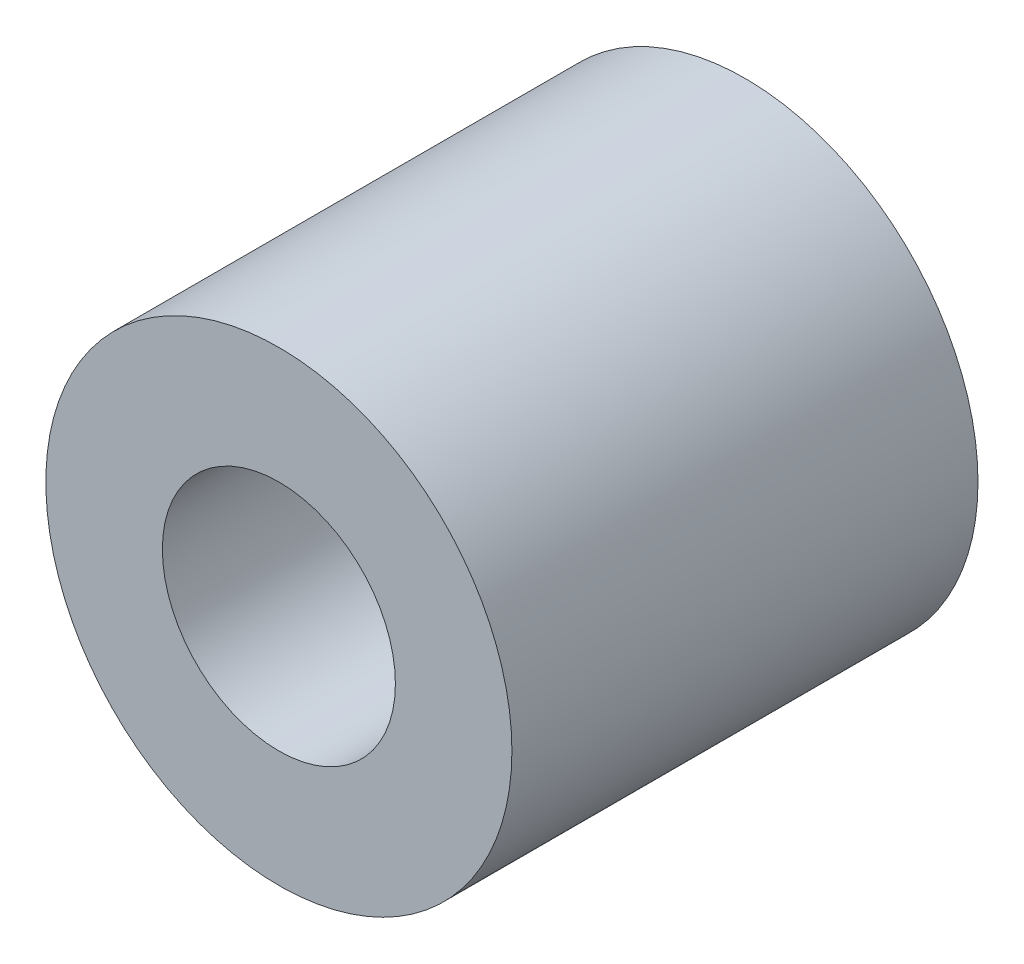
ISO-10303-21;
HEADER;
FILE_DESCRIPTION(('STEP AP214'),'2;1');
FILE_NAME('part.step','',(''),(''),'','','');
FILE_SCHEMA(('AUTOMOTIVE_DESIGN { 1 0 10303 214 1 1 1 1 }'));
ENDSEC;
DATA;
#1=APPLICATION_CONTEXT('core data for automotive mechanical design processes');
#2=APPLICATION_PROTOCOL_DEFINITION('international standard','automotive_design',2000,#1);
#3=PRODUCT_CONTEXT('',#1,'mechanical');
#4=PRODUCT('Part','Part','',(#3));
#5=PRODUCT_RELATED_PRODUCT_CATEGORY('part','',(#4));
#6=PRODUCT_DEFINITION_FORMATION('','',#4);
#7=PRODUCT_DEFINITION_CONTEXT('part definition',#1,'design');
#8=PRODUCT_DEFINITION('design','',#6,#7);
#9=PRODUCT_DEFINITION_SHAPE('','',#8);
#10=(LENGTH_UNIT() NAMED_UNIT(*) SI_UNIT(.MILLI.,.METRE.));
#11=(NAMED_UNIT(*) PLANE_ANGLE_UNIT() SI_UNIT($,.RADIAN.));
#12=(NAMED_UNIT(*) SI_UNIT($,.STERADIAN.) SOLID_ANGLE_UNIT());
#13=UNCERTAINTY_MEASURE_WITH_UNIT(LENGTH_MEASURE(1.E-05),#10,'distance_accuracy_value','');
#14=(GEOMETRIC_REPRESENTATION_CONTEXT(3) GLOBAL_UNCERTAINTY_ASSIGNED_CONTEXT((#13)) GLOBAL_UNIT_ASSIGNED_CONTEXT((#10,
#11,#12)) REPRESENTATION_CONTEXT('',''));
#15=CARTESIAN_POINT('',(0.,0.,0.));
#16=DIRECTION('',(0.,0.,1.));
#17=DIRECTION('',(1.,0.,0.));
#18=AXIS2_PLACEMENT_3D('',#15,#16,#17);
#19=CARTESIAN_POINT('',(0.,0.,10.));
#20=DIRECTION('',(0.,0.,1.));
#21=DIRECTION('',(1.,0.,0.));
#22=AXIS2_PLACEMENT_3D('',#19,#20,#21);
#23=PLANE('',#22);
#24=CARTESIAN_POINT('',(0.,0.,10.));
#25=DIRECTION('',(0.,0.,1.));
#26=DIRECTION('',(1.,0.,0.));
#27=AXIS2_PLACEMENT_3D('',#24,#25,#26);
#28=CIRCLE('',#27,5.);
#29=CARTESIAN_POINT('',(5.,0.,10.));
#30=VERTEX_POINT('',#29);
#31=EDGE_CURVE('E10',#30,#30,#28,.T.);
#32=ORIENTED_EDGE('',*,*,#31,.T.);
#33=EDGE_LOOP('',(#32));
#34=FACE_BOUND('',#33,.T.);
#35=CARTESIAN_POINT('',(0.,0.,10.));
#36=DIRECTION('',(0.,0.,1.));
#37=DIRECTION('',(1.,0.,0.));
#38=AXIS2_PLACEMENT_3D('',#35,#36,#37);
#39=CIRCLE('',#38,2.5);
#40=CARTESIAN_POINT('',(2.5,0.,10.));
#41=VERTEX_POINT('',#40);
#42=EDGE_CURVE('E46',#41,#41,#39,.T.);
#43=ORIENTED_EDGE('',*,*,#42,.F.);
#44=EDGE_LOOP('',(#43));
#45=FACE_BOUND('',#44,.T.);
#46=ADVANCED_FACE('F35',(#34,#45),#23,.T.);
#47=CARTESIAN_POINT('',(0.,0.,0.));
#48=DIRECTION('',(0.,0.,1.));
#49=DIRECTION('',(1.,0.,0.));
#50=AXIS2_PLACEMENT_3D('',#47,#48,#49);
#51=PLANE('',#50);
#52=CARTESIAN_POINT('',(0.,0.,0.));
#53=DIRECTION('',(0.,0.,1.));
#54=DIRECTION('',(1.,0.,0.));
#55=AXIS2_PLACEMENT_3D('',#52,#53,#54);
#56=CIRCLE('',#55,5.);
#57=CARTESIAN_POINT('',(5.,0.,0.));
#58=VERTEX_POINT('',#57);
#59=EDGE_CURVE('E39',#58,#58,#56,.T.);
#60=ORIENTED_EDGE('',*,*,#59,.F.);
#61=EDGE_LOOP('',(#60));
#62=FACE_BOUND('',#61,.T.);
#63=CARTESIAN_POINT('',(0.,0.,0.));
#64=DIRECTION('',(0.,0.,1.));
#65=DIRECTION('',(1.,0.,0.));
#66=AXIS2_PLACEMENT_3D('',#63,#64,#65);
#67=CIRCLE('',#66,2.5);
#68=CARTESIAN_POINT('',(2.5,0.,0.));
#69=VERTEX_POINT('',#68);
#70=EDGE_CURVE('E48',#69,#69,#67,.T.);
#71=ORIENTED_EDGE('',*,*,#70,.T.);
#72=EDGE_LOOP('',(#71));
#73=FACE_BOUND('',#72,.T.);
#74=ADVANCED_FACE('F58',(#62,#73),#51,.F.);
#75=CARTESIAN_POINT('',(0.,0.,10.));
#76=DIRECTION('',(0.,0.,-1.));
#77=DIRECTION('',(-1.,0.,0.));
#78=AXIS2_PLACEMENT_3D('',#75,#76,#77);
#79=CYLINDRICAL_SURFACE('',#78,5.);
#80=ORIENTED_EDGE('',*,*,#31,.F.);
#81=EDGE_LOOP('',(#80));
#82=FACE_BOUND('',#81,.T.);
#83=ORIENTED_EDGE('',*,*,#59,.T.);
#84=EDGE_LOOP('',(#83));
#85=FACE_BOUND('',#84,.T.);
#86=ADVANCED_FACE('F37',(#82,#85),#79,.T.);
#87=CARTESIAN_POINT('',(0.,0.,10.));
#88=DIRECTION('',(0.,0.,-1.));
#89=DIRECTION('',(-1.,0.,0.));
#90=AXIS2_PLACEMENT_3D('',#87,#88,#89);
#91=CYLINDRICAL_SURFACE('',#90,2.5);
#92=ORIENTED_EDGE('',*,*,#42,.T.);
#93=EDGE_LOOP('',(#92));
#94=FACE_BOUND('',#93,.T.);
#95=ORIENTED_EDGE('',*,*,#70,.F.);
#96=EDGE_LOOP('',(#95));
#97=FACE_BOUND('',#96,.T.);
#98=ADVANCED_FACE('F54',(#94,#97),#91,.F.);
#99=CLOSED_SHELL('',(#46,#74,#86,#98));
#100=MANIFOLD_SOLID_BREP('B2',#99);
#101=ADVANCED_BREP_SHAPE_REPRESENTATION('',(#18,#100),#14);
#102=SHAPE_DEFINITION_REPRESENTATION(#9,#101);
ENDSEC;
END-ISO-10303-21;
